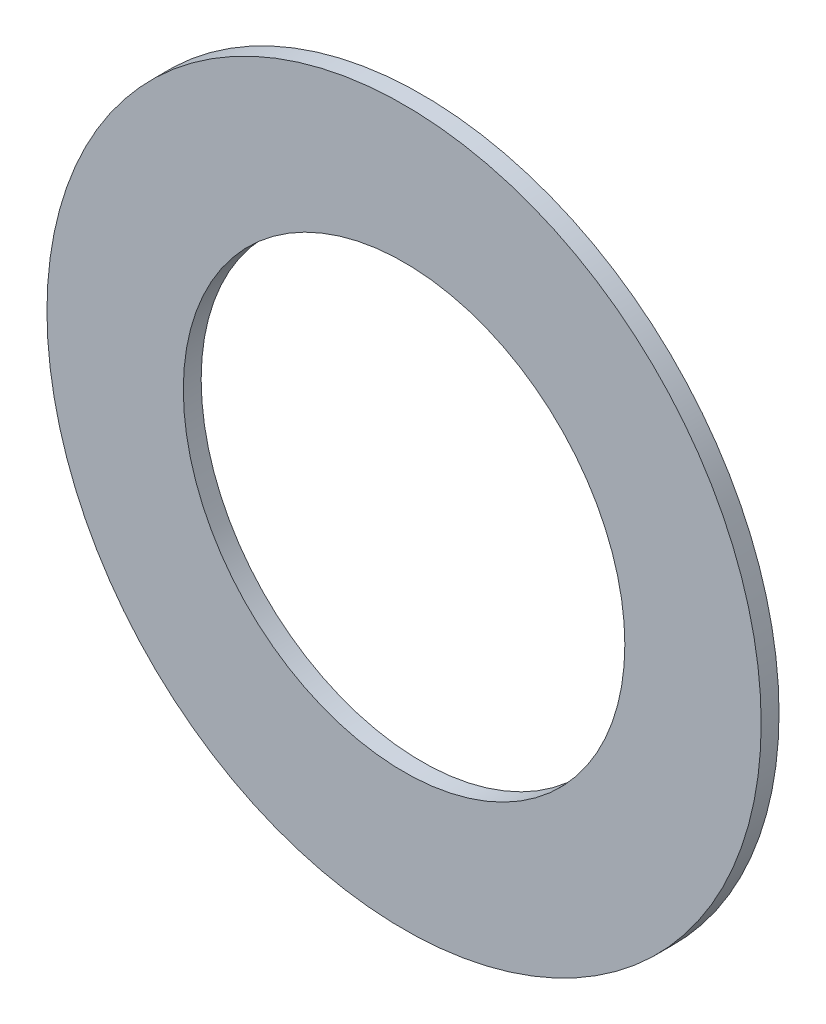
ISO-10303-21;
HEADER;
FILE_DESCRIPTION(('STEP AP214'),'2;1');
FILE_NAME('part.step','',(''),(''),'','','');
FILE_SCHEMA(('AUTOMOTIVE_DESIGN { 1 0 10303 214 1 1 1 1 }'));
ENDSEC;
DATA;
#1=APPLICATION_CONTEXT('core data for automotive mechanical design processes');
#2=APPLICATION_PROTOCOL_DEFINITION('international standard','automotive_design',2000,#1);
#3=PRODUCT_CONTEXT('',#1,'mechanical');
#4=PRODUCT('Part','Part','',(#3));
#5=PRODUCT_RELATED_PRODUCT_CATEGORY('part','',(#4));
#6=PRODUCT_DEFINITION_FORMATION('','',#4);
#7=PRODUCT_DEFINITION_CONTEXT('part definition',#1,'design');
#8=PRODUCT_DEFINITION('design','',#6,#7);
#9=PRODUCT_DEFINITION_SHAPE('','',#8);
#10=(LENGTH_UNIT() NAMED_UNIT(*) SI_UNIT(.MILLI.,.METRE.));
#11=(NAMED_UNIT(*) PLANE_ANGLE_UNIT() SI_UNIT($,.RADIAN.));
#12=(NAMED_UNIT(*) SI_UNIT($,.STERADIAN.) SOLID_ANGLE_UNIT());
#13=UNCERTAINTY_MEASURE_WITH_UNIT(LENGTH_MEASURE(1.E-05),#10,'distance_accuracy_value','');
#14=(GEOMETRIC_REPRESENTATION_CONTEXT(3) GLOBAL_UNCERTAINTY_ASSIGNED_CONTEXT((#13)) GLOBAL_UNIT_ASSIGNED_CONTEXT((#10,
#11,#12)) REPRESENTATION_CONTEXT('',''));
#15=CARTESIAN_POINT('',(0.,0.,0.));
#16=DIRECTION('',(0.,0.,1.));
#17=DIRECTION('',(1.,0.,0.));
#18=AXIS2_PLACEMENT_3D('',#15,#16,#17);
#19=CARTESIAN_POINT('',(0.,0.,3.175));
#20=DIRECTION('',(0.,0.,1.));
#21=DIRECTION('',(1.,0.,0.));
#22=AXIS2_PLACEMENT_3D('',#19,#20,#21);
#23=PLANE('',#22);
#24=CARTESIAN_POINT('',(0.,0.,3.175));
#25=DIRECTION('',(0.,0.,1.));
#26=DIRECTION('',(1.,0.,0.));
#27=AXIS2_PLACEMENT_3D('',#24,#25,#26);
#28=CIRCLE('',#27,63.5);
#29=CARTESIAN_POINT('',(63.5,0.,3.175));
#30=VERTEX_POINT('',#29);
#31=EDGE_CURVE('E10',#30,#30,#28,.T.);
#32=ORIENTED_EDGE('',*,*,#31,.T.);
#33=EDGE_LOOP('',(#32));
#34=FACE_BOUND('',#33,.T.);
#35=CARTESIAN_POINT('',(0.,0.,3.175));
#36=DIRECTION('',(0.,0.,1.));
#37=DIRECTION('',(1.,0.,0.));
#38=AXIS2_PLACEMENT_3D('',#35,#36,#37);
#39=CIRCLE('',#38,39.2557);
#40=CARTESIAN_POINT('',(39.2557,0.,3.175));
#41=VERTEX_POINT('',#40);
#42=EDGE_CURVE('E53',#41,#41,#39,.T.);
#43=ORIENTED_EDGE('',*,*,#42,.F.);
#44=EDGE_LOOP('',(#43));
#45=FACE_BOUND('',#44,.T.);
#46=ADVANCED_FACE('F39',(#34,#45),#23,.T.);
#47=CARTESIAN_POINT('',(0.,0.,0.));
#48=DIRECTION('',(0.,0.,1.));
#49=DIRECTION('',(1.,0.,0.));
#50=AXIS2_PLACEMENT_3D('',#47,#48,#49);
#51=PLANE('',#50);
#52=CARTESIAN_POINT('',(0.,0.,0.));
#53=DIRECTION('',(0.,0.,1.));
#54=DIRECTION('',(1.,0.,0.));
#55=AXIS2_PLACEMENT_3D('',#52,#53,#54);
#56=CIRCLE('',#55,63.5);
#57=CARTESIAN_POINT('',(63.5,0.,0.));
#58=VERTEX_POINT('',#57);
#59=EDGE_CURVE('E43',#58,#58,#56,.T.);
#60=ORIENTED_EDGE('',*,*,#59,.F.);
#61=EDGE_LOOP('',(#60));
#62=FACE_BOUND('',#61,.T.);
#63=CARTESIAN_POINT('',(0.,0.,0.));
#64=DIRECTION('',(0.,0.,1.));
#65=DIRECTION('',(1.,0.,0.));
#66=AXIS2_PLACEMENT_3D('',#63,#64,#65);
#67=CIRCLE('',#66,39.2557);
#68=CARTESIAN_POINT('',(39.2557,0.,0.));
#69=VERTEX_POINT('',#68);
#70=EDGE_CURVE('E55',#69,#69,#67,.T.);
#71=ORIENTED_EDGE('',*,*,#70,.T.);
#72=EDGE_LOOP('',(#71));
#73=FACE_BOUND('',#72,.T.);
#74=ADVANCED_FACE('F68',(#62,#73),#51,.F.);
#75=CARTESIAN_POINT('',(0.,0.,3.175));
#76=DIRECTION('',(0.,0.,-1.));
#77=DIRECTION('',(-1.,0.,0.));
#78=AXIS2_PLACEMENT_3D('',#75,#76,#77);
#79=CYLINDRICAL_SURFACE('',#78,63.5);
#80=ORIENTED_EDGE('',*,*,#31,.F.);
#81=EDGE_LOOP('',(#80));
#82=FACE_BOUND('',#81,.T.);
#83=ORIENTED_EDGE('',*,*,#59,.T.);
#84=EDGE_LOOP('',(#83));
#85=FACE_BOUND('',#84,.T.);
#86=ADVANCED_FACE('F41',(#82,#85),#79,.T.);
#87=CARTESIAN_POINT('',(0.,0.,3.175));
#88=DIRECTION('',(0.,0.,-1.));
#89=DIRECTION('',(-1.,0.,0.));
#90=AXIS2_PLACEMENT_3D('',#87,#88,#89);
#91=CYLINDRICAL_SURFACE('',#90,39.2557);
#92=ORIENTED_EDGE('',*,*,#42,.T.);
#93=EDGE_LOOP('',(#92));
#94=FACE_BOUND('',#93,.T.);
#95=ORIENTED_EDGE('',*,*,#70,.F.);
#96=EDGE_LOOP('',(#95));
#97=FACE_BOUND('',#96,.T.);
#98=ADVANCED_FACE('F64',(#94,#97),#91,.F.);
#99=CLOSED_SHELL('',(#46,#74,#86,#98));
#100=MANIFOLD_SOLID_BREP('B2',#99);
#101=ADVANCED_BREP_SHAPE_REPRESENTATION('',(#18,#100),#14);
#102=SHAPE_DEFINITION_REPRESENTATION(#9,#101);
ENDSEC;
END-ISO-10303-21;
